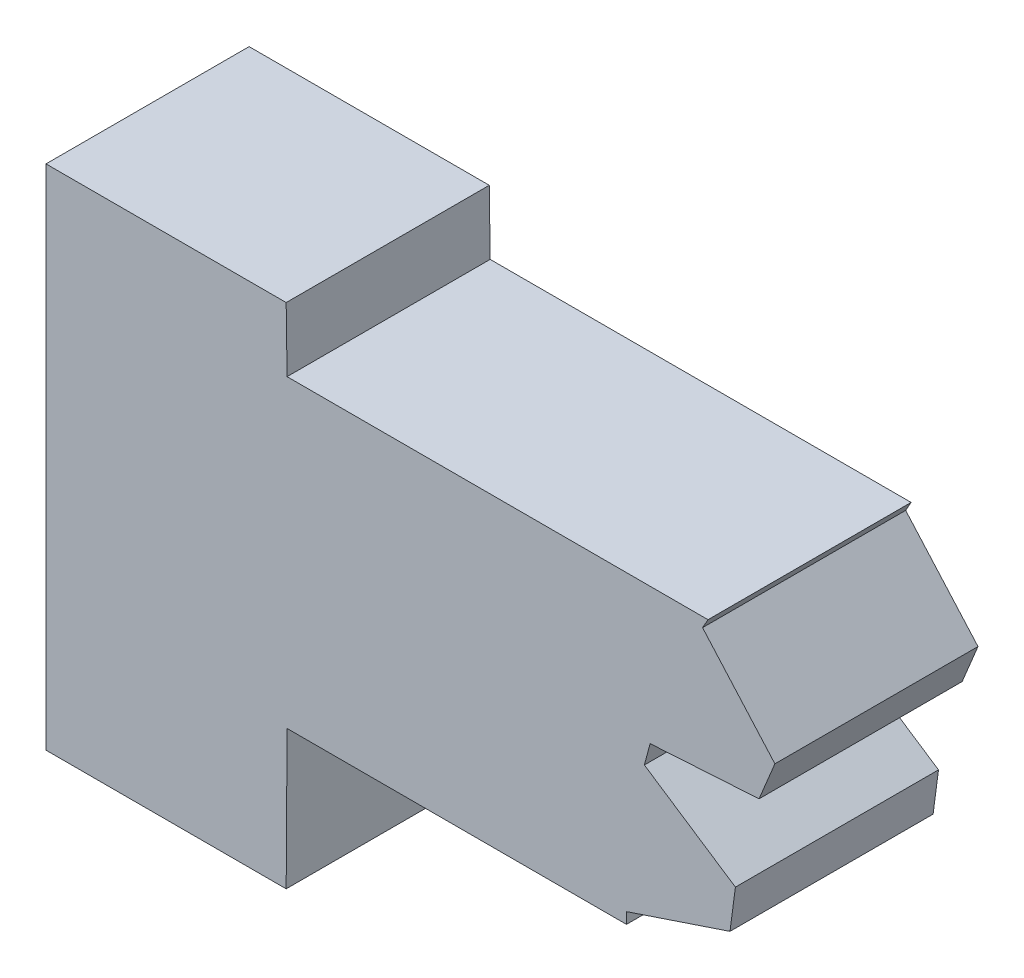
ISO-10303-21;
HEADER;
FILE_DESCRIPTION(('STEP AP214'),'2;1');
FILE_NAME('part.step','',(''),(''),'','','');
FILE_SCHEMA(('AUTOMOTIVE_DESIGN { 1 0 10303 214 1 1 1 1 }'));
ENDSEC;
DATA;
#1=APPLICATION_CONTEXT('core data for automotive mechanical design processes');
#2=APPLICATION_PROTOCOL_DEFINITION('international standard','automotive_design',2000,#1);
#3=PRODUCT_CONTEXT('',#1,'mechanical');
#4=PRODUCT('Part','Part','',(#3));
#5=PRODUCT_RELATED_PRODUCT_CATEGORY('part','',(#4));
#6=PRODUCT_DEFINITION_FORMATION('','',#4);
#7=PRODUCT_DEFINITION_CONTEXT('part definition',#1,'design');
#8=PRODUCT_DEFINITION('design','',#6,#7);
#9=PRODUCT_DEFINITION_SHAPE('','',#8);
#10=(LENGTH_UNIT() NAMED_UNIT(*) SI_UNIT(.MILLI.,.METRE.));
#11=(NAMED_UNIT(*) PLANE_ANGLE_UNIT() SI_UNIT($,.RADIAN.));
#12=(NAMED_UNIT(*) SI_UNIT($,.STERADIAN.) SOLID_ANGLE_UNIT());
#13=UNCERTAINTY_MEASURE_WITH_UNIT(LENGTH_MEASURE(1.E-05),#10,'distance_accuracy_value','');
#14=(GEOMETRIC_REPRESENTATION_CONTEXT(3) GLOBAL_UNCERTAINTY_ASSIGNED_CONTEXT((#13)) GLOBAL_UNIT_ASSIGNED_CONTEXT((#10,
#11,#12)) REPRESENTATION_CONTEXT('',''));
#15=CARTESIAN_POINT('',(0.,0.,0.));
#16=DIRECTION('',(0.,0.,1.));
#17=DIRECTION('',(1.,0.,0.));
#18=AXIS2_PLACEMENT_3D('',#15,#16,#17);
#19=CARTESIAN_POINT('',(12.9304605352733,8.55490384085248,4.));
#20=DIRECTION('',(-0.870533332407199,0.492109456491152,0.));
#21=DIRECTION('',(-0.492109456491152,-0.870533332407199,0.));
#22=AXIS2_PLACEMENT_3D('',#19,#20,#21);
#23=PLANE('',#22);
#24=DIRECTION('',(0.492109456491152,0.870533332407199,0.));
#25=VECTOR('',#24,1.);
#26=CARTESIAN_POINT('',(12.9304605352733,8.55490384085248,0.));
#27=LINE('',#26,#25);
#28=CARTESIAN_POINT('',(12.9304605352733,8.55490384085248,0.));
#29=VERTEX_POINT('',#28);
#30=CARTESIAN_POINT('',(13.0377837049311,8.74475671869166,0.));
#31=VERTEX_POINT('',#30);
#32=EDGE_CURVE('E177',#29,#31,#27,.T.);
#33=ORIENTED_EDGE('',*,*,#32,.T.);
#34=DIRECTION('',(0.,0.,-1.));
#35=VECTOR('',#34,1.);
#36=CARTESIAN_POINT('',(13.0377837049311,8.74475671869166,4.));
#37=LINE('',#36,#35);
#38=CARTESIAN_POINT('',(13.0377837049311,8.74475671869166,4.));
#39=VERTEX_POINT('',#38);
#40=EDGE_CURVE('E11',#39,#31,#37,.T.);
#41=ORIENTED_EDGE('',*,*,#40,.F.);
#42=DIRECTION('',(0.492109456491152,0.870533332407199,0.));
#43=VECTOR('',#42,1.);
#44=CARTESIAN_POINT('',(12.9304605352733,8.55490384085248,4.));
#45=LINE('',#44,#43);
#46=CARTESIAN_POINT('',(12.9304605352733,8.55490384085248,4.));
#47=VERTEX_POINT('',#46);
#48=EDGE_CURVE('E207',#47,#39,#45,.T.);
#49=ORIENTED_EDGE('',*,*,#48,.F.);
#50=DIRECTION('',(0.,0.,-1.));
#51=VECTOR('',#50,1.);
#52=CARTESIAN_POINT('',(12.9304605352733,8.55490384085248,4.));
#53=LINE('',#52,#51);
#54=EDGE_CURVE('E173',#47,#29,#53,.T.);
#55=ORIENTED_EDGE('',*,*,#54,.T.);
#56=EDGE_LOOP('',(#33,#41,#49,#55));
#57=FACE_BOUND('',#56,.T.);
#58=ADVANCED_FACE('F33',(#57),#23,.F.);
#59=CARTESIAN_POINT('',(4.74778370493112,8.74475671869166,4.));
#60=DIRECTION('',(0.,-1.,0.));
#61=DIRECTION('',(0.,0.,-1.));
#62=AXIS2_PLACEMENT_3D('',#59,#60,#61);
#63=PLANE('',#62);
#64=DIRECTION('',(-1.,0.,0.));
#65=VECTOR('',#64,1.);
#66=CARTESIAN_POINT('',(4.74778370493112,8.74475671869166,0.));
#67=LINE('',#66,#65);
#68=CARTESIAN_POINT('',(4.74778370493112,8.74475671869166,0.));
#69=VERTEX_POINT('',#68);
#70=EDGE_CURVE('E180',#31,#69,#67,.T.);
#71=ORIENTED_EDGE('',*,*,#70,.T.);
#72=DIRECTION('',(0.,0.,-1.));
#73=VECTOR('',#72,1.);
#74=CARTESIAN_POINT('',(4.74778370493112,8.74475671869166,4.));
#75=LINE('',#74,#73);
#76=CARTESIAN_POINT('',(4.74778370493112,8.74475671869166,4.));
#77=VERTEX_POINT('',#76);
#78=EDGE_CURVE('E41',#77,#69,#75,.T.);
#79=ORIENTED_EDGE('',*,*,#78,.F.);
#80=DIRECTION('',(-1.,0.,0.));
#81=VECTOR('',#80,1.);
#82=CARTESIAN_POINT('',(4.74778370493112,8.74475671869166,4.));
#83=LINE('',#82,#81);
#84=EDGE_CURVE('E116',#39,#77,#83,.T.);
#85=ORIENTED_EDGE('',*,*,#84,.F.);
#86=ORIENTED_EDGE('',*,*,#40,.T.);
#87=EDGE_LOOP('',(#71,#79,#85,#86));
#88=FACE_BOUND('',#87,.T.);
#89=ADVANCED_FACE('F305',(#88),#63,.F.);
#90=CARTESIAN_POINT('',(4.73,10.,4.));
#91=DIRECTION('',(-0.999899655561117,-0.01416611480819,0.));
#92=DIRECTION('',(0.01416611480819,-0.999899655561117,0.));
#93=AXIS2_PLACEMENT_3D('',#90,#91,#92);
#94=PLANE('',#93);
#95=DIRECTION('',(-0.01416611480819,0.999899655561117,0.));
#96=VECTOR('',#95,1.);
#97=CARTESIAN_POINT('',(4.73,10.,0.));
#98=LINE('',#97,#96);
#99=CARTESIAN_POINT('',(4.73,10.,0.));
#100=VERTEX_POINT('',#99);
#101=EDGE_CURVE('E182',#69,#100,#98,.T.);
#102=ORIENTED_EDGE('',*,*,#101,.T.);
#103=DIRECTION('',(0.,0.,-1.));
#104=VECTOR('',#103,1.);
#105=CARTESIAN_POINT('',(4.73,10.,4.));
#106=LINE('',#105,#104);
#107=CARTESIAN_POINT('',(4.73,10.,4.));
#108=VERTEX_POINT('',#107);
#109=EDGE_CURVE('E238',#108,#100,#106,.T.);
#110=ORIENTED_EDGE('',*,*,#109,.F.);
#111=DIRECTION('',(-0.01416611480819,0.999899655561117,0.));
#112=VECTOR('',#111,1.);
#113=CARTESIAN_POINT('',(4.73,10.,4.));
#114=LINE('',#113,#112);
#115=EDGE_CURVE('E246',#77,#108,#114,.T.);
#116=ORIENTED_EDGE('',*,*,#115,.F.);
#117=ORIENTED_EDGE('',*,*,#78,.T.);
#118=EDGE_LOOP('',(#102,#110,#116,#117));
#119=FACE_BOUND('',#118,.T.);
#120=ADVANCED_FACE('F244',(#119),#94,.F.);
#121=CARTESIAN_POINT('',(4.73,10.,4.));
#122=DIRECTION('',(0.,-1.,0.));
#123=DIRECTION('',(0.,0.,-1.));
#124=AXIS2_PLACEMENT_3D('',#121,#122,#123);
#125=PLANE('',#124);
#126=DIRECTION('',(-1.,0.,0.));
#127=VECTOR('',#126,1.);
#128=CARTESIAN_POINT('',(4.73,10.,0.));
#129=LINE('',#128,#127);
#130=CARTESIAN_POINT('',(0.,10.,0.));
#131=VERTEX_POINT('',#130);
#132=EDGE_CURVE('E184',#100,#131,#129,.T.);
#133=ORIENTED_EDGE('',*,*,#132,.T.);
#134=DIRECTION('',(0.,0.,-1.));
#135=VECTOR('',#134,1.);
#136=CARTESIAN_POINT('',(0.,10.,4.));
#137=LINE('',#136,#135);
#138=CARTESIAN_POINT('',(0.,10.,4.));
#139=VERTEX_POINT('',#138);
#140=EDGE_CURVE('E235',#139,#131,#137,.T.);
#141=ORIENTED_EDGE('',*,*,#140,.F.);
#142=DIRECTION('',(-1.,0.,0.));
#143=VECTOR('',#142,1.);
#144=CARTESIAN_POINT('',(4.73,10.,4.));
#145=LINE('',#144,#143);
#146=EDGE_CURVE('E264',#108,#139,#145,.T.);
#147=ORIENTED_EDGE('',*,*,#146,.F.);
#148=ORIENTED_EDGE('',*,*,#109,.T.);
#149=EDGE_LOOP('',(#133,#141,#147,#148));
#150=FACE_BOUND('',#149,.T.);
#151=ADVANCED_FACE('F255',(#150),#125,.F.);
#152=CARTESIAN_POINT('',(0.,0.,4.));
#153=DIRECTION('',(1.,0.,0.));
#154=DIRECTION('',(0.,0.,-1.));
#155=AXIS2_PLACEMENT_3D('',#152,#153,#154);
#156=PLANE('',#155);
#157=DIRECTION('',(0.,-1.,0.));
#158=VECTOR('',#157,1.);
#159=CARTESIAN_POINT('',(0.,0.,0.));
#160=LINE('',#159,#158);
#161=CARTESIAN_POINT('',(0.,0.,0.));
#162=VERTEX_POINT('',#161);
#163=EDGE_CURVE('E186',#131,#162,#160,.T.);
#164=ORIENTED_EDGE('',*,*,#163,.T.);
#165=DIRECTION('',(0.,0.,-1.));
#166=VECTOR('',#165,1.);
#167=CARTESIAN_POINT('',(0.,0.,4.));
#168=LINE('',#167,#166);
#169=CARTESIAN_POINT('',(0.,0.,4.));
#170=VERTEX_POINT('',#169);
#171=EDGE_CURVE('E232',#170,#162,#168,.T.);
#172=ORIENTED_EDGE('',*,*,#171,.F.);
#173=DIRECTION('',(0.,-1.,0.));
#174=VECTOR('',#173,1.);
#175=CARTESIAN_POINT('',(0.,0.,4.));
#176=LINE('',#175,#174);
#177=EDGE_CURVE('E261',#139,#170,#176,.T.);
#178=ORIENTED_EDGE('',*,*,#177,.F.);
#179=ORIENTED_EDGE('',*,*,#140,.T.);
#180=EDGE_LOOP('',(#164,#172,#178,#179));
#181=FACE_BOUND('',#180,.T.);
#182=ADVANCED_FACE('F259',(#181),#156,.F.);
#183=CARTESIAN_POINT('',(4.73,0.,4.));
#184=DIRECTION('',(0.,1.,0.));
#185=DIRECTION('',(0.,0.,1.));
#186=AXIS2_PLACEMENT_3D('',#183,#184,#185);
#187=PLANE('',#186);
#188=DIRECTION('',(1.,0.,0.));
#189=VECTOR('',#188,1.);
#190=CARTESIAN_POINT('',(4.73,0.,0.));
#191=LINE('',#190,#189);
#192=CARTESIAN_POINT('',(4.73,0.,0.));
#193=VERTEX_POINT('',#192);
#194=EDGE_CURVE('E188',#162,#193,#191,.T.);
#195=ORIENTED_EDGE('',*,*,#194,.T.);
#196=DIRECTION('',(0.,0.,-1.));
#197=VECTOR('',#196,1.);
#198=CARTESIAN_POINT('',(4.73,0.,4.));
#199=LINE('',#198,#197);
#200=CARTESIAN_POINT('',(4.73,0.,4.));
#201=VERTEX_POINT('',#200);
#202=EDGE_CURVE('E229',#201,#193,#199,.T.);
#203=ORIENTED_EDGE('',*,*,#202,.F.);
#204=DIRECTION('',(1.,0.,0.));
#205=VECTOR('',#204,1.);
#206=CARTESIAN_POINT('',(4.73,0.,4.));
#207=LINE('',#206,#205);
#208=EDGE_CURVE('E263',#170,#201,#207,.T.);
#209=ORIENTED_EDGE('',*,*,#208,.F.);
#210=ORIENTED_EDGE('',*,*,#171,.T.);
#211=EDGE_LOOP('',(#195,#203,#209,#210));
#212=FACE_BOUND('',#211,.T.);
#213=ADVANCED_FACE('F318',(#212),#187,.F.);
#214=CARTESIAN_POINT('',(4.74778370493112,2.74476455823996,4.));
#215=DIRECTION('',(-0.999979011054282,0.00647900076402233,0.));
#216=DIRECTION('',(-0.00647900076402233,-0.999979011054282,0.));
#217=AXIS2_PLACEMENT_3D('',#214,#215,#216);
#218=PLANE('',#217);
#219=DIRECTION('',(0.00647900076402233,0.999979011054282,0.));
#220=VECTOR('',#219,1.);
#221=CARTESIAN_POINT('',(4.74778370493112,2.74476455823996,0.));
#222=LINE('',#221,#220);
#223=CARTESIAN_POINT('',(4.74778370493112,2.74476455823996,0.));
#224=VERTEX_POINT('',#223);
#225=EDGE_CURVE('E190',#193,#224,#222,.T.);
#226=ORIENTED_EDGE('',*,*,#225,.T.);
#227=DIRECTION('',(0.,0.,-1.));
#228=VECTOR('',#227,1.);
#229=CARTESIAN_POINT('',(4.74778370493112,2.74476455823996,4.));
#230=LINE('',#229,#228);
#231=CARTESIAN_POINT('',(4.74778370493112,2.74476455823996,4.));
#232=VERTEX_POINT('',#231);
#233=EDGE_CURVE('E226',#232,#224,#230,.T.);
#234=ORIENTED_EDGE('',*,*,#233,.F.);
#235=DIRECTION('',(0.00647900076402233,0.999979011054282,0.));
#236=VECTOR('',#235,1.);
#237=CARTESIAN_POINT('',(4.74778370493112,2.74476455823996,4.));
#238=LINE('',#237,#236);
#239=EDGE_CURVE('E266',#201,#232,#238,.T.);
#240=ORIENTED_EDGE('',*,*,#239,.F.);
#241=ORIENTED_EDGE('',*,*,#202,.T.);
#242=EDGE_LOOP('',(#226,#234,#240,#241));
#243=FACE_BOUND('',#242,.T.);
#244=ADVANCED_FACE('F321',(#243),#218,.F.);
#245=CARTESIAN_POINT('',(4.74778370493112,2.74476455823996,4.));
#246=DIRECTION('',(0.,1.,0.));
#247=DIRECTION('',(0.,0.,1.));
#248=AXIS2_PLACEMENT_3D('',#245,#246,#247);
#249=PLANE('',#248);
#250=DIRECTION('',(1.,0.,0.));
#251=VECTOR('',#250,1.);
#252=CARTESIAN_POINT('',(4.74778370493112,2.74476455823996,0.));
#253=LINE('',#252,#251);
#254=CARTESIAN_POINT('',(11.4320749114308,2.74476455823996,0.));
#255=VERTEX_POINT('',#254);
#256=EDGE_CURVE('E192',#224,#255,#253,.T.);
#257=ORIENTED_EDGE('',*,*,#256,.T.);
#258=DIRECTION('',(0.,0.,-1.));
#259=VECTOR('',#258,1.);
#260=CARTESIAN_POINT('',(11.4320749114308,2.74476455823996,4.));
#261=LINE('',#260,#259);
#262=CARTESIAN_POINT('',(11.4320749114308,2.74476455823996,4.));
#263=VERTEX_POINT('',#262);
#264=EDGE_CURVE('E223',#263,#255,#261,.T.);
#265=ORIENTED_EDGE('',*,*,#264,.F.);
#266=DIRECTION('',(1.,0.,0.));
#267=VECTOR('',#266,1.);
#268=CARTESIAN_POINT('',(4.74778370493112,2.74476455823996,4.));
#269=LINE('',#268,#267);
#270=EDGE_CURVE('E272',#232,#263,#269,.T.);
#271=ORIENTED_EDGE('',*,*,#270,.F.);
#272=ORIENTED_EDGE('',*,*,#233,.T.);
#273=EDGE_LOOP('',(#257,#265,#271,#272));
#274=FACE_BOUND('',#273,.T.);
#275=ADVANCED_FACE('F325',(#274),#249,.F.);
#276=CARTESIAN_POINT('',(11.4320749114308,2.74476455823996,4.));
#277=DIRECTION('',(-1.,0.,0.));
#278=DIRECTION('',(0.,0.,1.));
#279=AXIS2_PLACEMENT_3D('',#276,#277,#278);
#280=PLANE('',#279);
#281=DIRECTION('',(0.,1.,0.));
#282=VECTOR('',#281,1.);
#283=CARTESIAN_POINT('',(11.4320749114308,2.74476455823996,0.));
#284=LINE('',#283,#282);
#285=CARTESIAN_POINT('',(11.4320749114308,2.96285256334162,0.));
#286=VERTEX_POINT('',#285);
#287=EDGE_CURVE('E194',#255,#286,#284,.T.);
#288=ORIENTED_EDGE('',*,*,#287,.T.);
#289=DIRECTION('',(0.,0.,-1.));
#290=VECTOR('',#289,1.);
#291=CARTESIAN_POINT('',(11.4320749114308,2.96285256334162,4.));
#292=LINE('',#291,#290);
#293=CARTESIAN_POINT('',(11.4320749114308,2.96285256334162,4.));
#294=VERTEX_POINT('',#293);
#295=EDGE_CURVE('E220',#294,#286,#292,.T.);
#296=ORIENTED_EDGE('',*,*,#295,.F.);
#297=DIRECTION('',(0.,1.,0.));
#298=VECTOR('',#297,1.);
#299=CARTESIAN_POINT('',(11.4320749114308,2.74476455823996,4.));
#300=LINE('',#299,#298);
#301=EDGE_CURVE('E274',#263,#294,#300,.T.);
#302=ORIENTED_EDGE('',*,*,#301,.F.);
#303=ORIENTED_EDGE('',*,*,#264,.T.);
#304=EDGE_LOOP('',(#288,#296,#302,#303));
#305=FACE_BOUND('',#304,.T.);
#306=ADVANCED_FACE('F329',(#305),#280,.F.);
#307=CARTESIAN_POINT('',(11.4320749114308,2.96285256334162,4.));
#308=DIRECTION('',(-0.31722342524605,0.948350830903397,0.));
#309=DIRECTION('',(-0.948350830903397,-0.31722342524605,0.));
#310=AXIS2_PLACEMENT_3D('',#307,#308,#309);
#311=PLANE('',#310);
#312=DIRECTION('',(0.948350830903397,0.31722342524605,0.));
#313=VECTOR('',#312,1.);
#314=CARTESIAN_POINT('',(11.4320749114308,2.96285256334162,0.));
#315=LINE('',#314,#313);
#316=CARTESIAN_POINT('',(13.4706753283553,3.64476455823994,0.));
#317=VERTEX_POINT('',#316);
#318=EDGE_CURVE('E196',#286,#317,#315,.T.);
#319=ORIENTED_EDGE('',*,*,#318,.T.);
#320=DIRECTION('',(0.,0.,-1.));
#321=VECTOR('',#320,1.);
#322=CARTESIAN_POINT('',(13.4706753283553,3.64476455823994,4.));
#323=LINE('',#322,#321);
#324=CARTESIAN_POINT('',(13.4706753283553,3.64476455823994,4.));
#325=VERTEX_POINT('',#324);
#326=EDGE_CURVE('E217',#325,#317,#323,.T.);
#327=ORIENTED_EDGE('',*,*,#326,.F.);
#328=DIRECTION('',(0.948350830903397,0.31722342524605,0.));
#329=VECTOR('',#328,1.);
#330=CARTESIAN_POINT('',(11.4320749114308,2.96285256334162,4.));
#331=LINE('',#330,#329);
#332=EDGE_CURVE('E276',#294,#325,#331,.T.);
#333=ORIENTED_EDGE('',*,*,#332,.F.);
#334=ORIENTED_EDGE('',*,*,#295,.T.);
#335=EDGE_LOOP('',(#319,#327,#333,#334));
#336=FACE_BOUND('',#335,.T.);
#337=ADVANCED_FACE('F333',(#336),#311,.F.);
#338=CARTESIAN_POINT('',(13.4706753283553,3.64476455823994,4.));
#339=DIRECTION('',(-0.991444861373811,0.130526192220048,0.));
#340=DIRECTION('',(-0.130526192220048,-0.991444861373811,0.));
#341=AXIS2_PLACEMENT_3D('',#338,#339,#340);
#342=PLANE('',#341);
#343=DIRECTION('',(0.130526192220048,0.991444861373811,0.));
#344=VECTOR('',#343,1.);
#345=CARTESIAN_POINT('',(13.4706753283553,3.64476455823994,0.));
#346=LINE('',#345,#344);
#347=CARTESIAN_POINT('',(13.5770971149535,4.45311828147681,0.));
#348=VERTEX_POINT('',#347);
#349=EDGE_CURVE('E198',#317,#348,#346,.T.);
#350=ORIENTED_EDGE('',*,*,#349,.T.);
#351=DIRECTION('',(0.,0.,-1.));
#352=VECTOR('',#351,1.);
#353=CARTESIAN_POINT('',(13.5770971149535,4.45311828147681,4.));
#354=LINE('',#353,#352);
#355=CARTESIAN_POINT('',(13.5770971149535,4.45311828147681,4.));
#356=VERTEX_POINT('',#355);
#357=EDGE_CURVE('E214',#356,#348,#354,.T.);
#358=ORIENTED_EDGE('',*,*,#357,.F.);
#359=DIRECTION('',(0.130526192220048,0.991444861373811,0.));
#360=VECTOR('',#359,1.);
#361=CARTESIAN_POINT('',(13.4706753283553,3.64476455823994,4.));
#362=LINE('',#361,#360);
#363=EDGE_CURVE('E278',#325,#356,#362,.T.);
#364=ORIENTED_EDGE('',*,*,#363,.F.);
#365=ORIENTED_EDGE('',*,*,#326,.T.);
#366=EDGE_LOOP('',(#350,#358,#364,#365));
#367=FACE_BOUND('',#366,.T.);
#368=ADVANCED_FACE('F337',(#367),#342,.F.);
#369=CARTESIAN_POINT('',(13.5770971149535,4.45311828147681,4.));
#370=DIRECTION('',(-0.551865555625634,-0.833933095945958,0.));
#371=DIRECTION('',(0.833933095945958,-0.551865555625634,0.));
#372=AXIS2_PLACEMENT_3D('',#369,#370,#371);
#373=PLANE('',#372);
#374=DIRECTION('',(-0.833933095945958,0.551865555625634,0.));
#375=VECTOR('',#374,1.);
#376=CARTESIAN_POINT('',(13.5770971149535,4.45311828147681,0.));
#377=LINE('',#376,#375);
#378=CARTESIAN_POINT('',(11.784452134126,5.63942330185938,0.));
#379=VERTEX_POINT('',#378);
#380=EDGE_CURVE('E200',#348,#379,#377,.T.);
#381=ORIENTED_EDGE('',*,*,#380,.T.);
#382=DIRECTION('',(0.,0.,-1.));
#383=VECTOR('',#382,1.);
#384=CARTESIAN_POINT('',(11.784452134126,5.63942330185938,4.));
#385=LINE('',#384,#383);
#386=CARTESIAN_POINT('',(11.784452134126,5.63942330185938,4.));
#387=VERTEX_POINT('',#386);
#388=EDGE_CURVE('E211',#387,#379,#385,.T.);
#389=ORIENTED_EDGE('',*,*,#388,.F.);
#390=DIRECTION('',(-0.833933095945958,0.551865555625634,0.));
#391=VECTOR('',#390,1.);
#392=CARTESIAN_POINT('',(13.5770971149535,4.45311828147681,4.));
#393=LINE('',#392,#391);
#394=EDGE_CURVE('E280',#356,#387,#393,.T.);
#395=ORIENTED_EDGE('',*,*,#394,.F.);
#396=ORIENTED_EDGE('',*,*,#357,.T.);
#397=EDGE_LOOP('',(#381,#389,#395,#396));
#398=FACE_BOUND('',#397,.T.);
#399=ADVANCED_FACE('F286',(#398),#373,.F.);
#400=CARTESIAN_POINT('',(11.784452134126,5.63942330185938,4.));
#401=DIRECTION('',(-0.965925826289063,0.258819045102539,0.));
#402=DIRECTION('',(-0.258819045102539,-0.965925826289063,0.));
#403=AXIS2_PLACEMENT_3D('',#400,#401,#402);
#404=PLANE('',#403);
#405=DIRECTION('',(0.258819045102539,0.965925826289064,0.));
#406=VECTOR('',#405,1.);
#407=CARTESIAN_POINT('',(11.784452134126,5.63942330185938,0.));
#408=LINE('',#407,#406);
#409=CARTESIAN_POINT('',(11.8973427925835,6.06073697492256,0.));
#410=VERTEX_POINT('',#409);
#411=EDGE_CURVE('E202',#379,#410,#408,.T.);
#412=ORIENTED_EDGE('',*,*,#411,.T.);
#413=DIRECTION('',(0.,0.,-1.));
#414=VECTOR('',#413,1.);
#415=CARTESIAN_POINT('',(11.8973427925835,6.06073697492256,4.));
#416=LINE('',#415,#414);
#417=CARTESIAN_POINT('',(11.8973427925835,6.06073697492256,4.));
#418=VERTEX_POINT('',#417);
#419=EDGE_CURVE('E168',#418,#410,#416,.T.);
#420=ORIENTED_EDGE('',*,*,#419,.F.);
#421=DIRECTION('',(0.258819045102539,0.965925826289064,0.));
#422=VECTOR('',#421,1.);
#423=CARTESIAN_POINT('',(11.784452134126,5.63942330185938,4.));
#424=LINE('',#423,#422);
#425=EDGE_CURVE('E159',#387,#418,#424,.T.);
#426=ORIENTED_EDGE('',*,*,#425,.F.);
#427=ORIENTED_EDGE('',*,*,#388,.T.);
#428=EDGE_LOOP('',(#412,#420,#426,#427));
#429=FACE_BOUND('',#428,.T.);
#430=ADVANCED_FACE('F290',(#429),#404,.F.);
#431=CARTESIAN_POINT('',(11.8973427925835,6.06073697492256,4.));
#432=DIRECTION('',(-0.060963042672375,0.998140023958626,0.));
#433=DIRECTION('',(-0.998140023958626,-0.060963042672375,0.));
#434=AXIS2_PLACEMENT_3D('',#431,#432,#433);
#435=PLANE('',#434);
#436=DIRECTION('',(0.998140023958626,0.060963042672375,0.));
#437=VECTOR('',#436,1.);
#438=CARTESIAN_POINT('',(11.8973427925835,6.06073697492256,0.));
#439=LINE('',#438,#437);
#440=CARTESIAN_POINT('',(14.0429713961381,6.19178476879701,0.));
#441=VERTEX_POINT('',#440);
#442=EDGE_CURVE('E167',#410,#441,#439,.T.);
#443=ORIENTED_EDGE('',*,*,#442,.T.);
#444=DIRECTION('',(0.,0.,-1.));
#445=VECTOR('',#444,1.);
#446=CARTESIAN_POINT('',(14.0429713961381,6.19178476879701,4.));
#447=LINE('',#446,#445);
#448=CARTESIAN_POINT('',(14.0429713961381,6.19178476879701,4.));
#449=VERTEX_POINT('',#448);
#450=EDGE_CURVE('E164',#449,#441,#447,.T.);
#451=ORIENTED_EDGE('',*,*,#450,.F.);
#452=DIRECTION('',(0.998140023958626,0.060963042672375,0.));
#453=VECTOR('',#452,1.);
#454=CARTESIAN_POINT('',(11.8973427925835,6.06073697492256,4.));
#455=LINE('',#454,#453);
#456=EDGE_CURVE('E153',#418,#449,#455,.T.);
#457=ORIENTED_EDGE('',*,*,#456,.F.);
#458=ORIENTED_EDGE('',*,*,#419,.T.);
#459=EDGE_LOOP('',(#443,#451,#457,#458));
#460=FACE_BOUND('',#459,.T.);
#461=ADVANCED_FACE('F165',(#460),#435,.F.);
#462=CARTESIAN_POINT('',(14.0429713961381,6.19178476879701,4.));
#463=DIRECTION('',(-0.923879532511289,0.382683432365085,0.));
#464=DIRECTION('',(-0.382683432365085,-0.923879532511289,0.));
#465=AXIS2_PLACEMENT_3D('',#462,#463,#464);
#466=PLANE('',#465);
#467=DIRECTION('',(0.382683432365085,0.923879532511289,0.));
#468=VECTOR('',#467,1.);
#469=CARTESIAN_POINT('',(14.0429713961381,6.19178476879701,0.));
#470=LINE('',#469,#468);
#471=CARTESIAN_POINT('',(14.3549842870463,6.94505052166298,0.));
#472=VERTEX_POINT('',#471);
#473=EDGE_CURVE('E102',#441,#472,#470,.T.);
#474=ORIENTED_EDGE('',*,*,#473,.T.);
#475=DIRECTION('',(0.,0.,-1.));
#476=VECTOR('',#475,1.);
#477=CARTESIAN_POINT('',(14.3549842870463,6.94505052166298,4.));
#478=LINE('',#477,#476);
#479=CARTESIAN_POINT('',(14.3549842870463,6.94505052166298,4.));
#480=VERTEX_POINT('',#479);
#481=EDGE_CURVE('E169',#480,#472,#478,.T.);
#482=ORIENTED_EDGE('',*,*,#481,.F.);
#483=DIRECTION('',(0.382683432365085,0.923879532511289,0.));
#484=VECTOR('',#483,1.);
#485=CARTESIAN_POINT('',(14.0429713961381,6.19178476879701,4.));
#486=LINE('',#485,#484);
#487=EDGE_CURVE('E157',#449,#480,#486,.T.);
#488=ORIENTED_EDGE('',*,*,#487,.F.);
#489=ORIENTED_EDGE('',*,*,#450,.T.);
#490=EDGE_LOOP('',(#474,#482,#488,#489));
#491=FACE_BOUND('',#490,.T.);
#492=ADVANCED_FACE('F171',(#491),#466,.F.);
#493=CARTESIAN_POINT('',(14.3549842870463,6.94505052166298,4.));
#494=DIRECTION('',(-0.748898960390284,-0.662684198639407,0.));
#495=DIRECTION('',(0.662684198639407,-0.748898960390284,0.));
#496=AXIS2_PLACEMENT_3D('',#493,#494,#495);
#497=PLANE('',#496);
#498=DIRECTION('',(-0.662684198639407,0.748898960390284,0.));
#499=VECTOR('',#498,1.);
#500=CARTESIAN_POINT('',(14.3549842870463,6.94505052166298,0.));
#501=LINE('',#500,#499);
#502=EDGE_CURVE('E108',#472,#29,#501,.T.);
#503=ORIENTED_EDGE('',*,*,#502,.T.);
#504=ORIENTED_EDGE('',*,*,#54,.F.);
#505=DIRECTION('',(-0.662684198639407,0.748898960390284,0.));
#506=VECTOR('',#505,1.);
#507=CARTESIAN_POINT('',(14.3549842870463,6.94505052166298,4.));
#508=LINE('',#507,#506);
#509=EDGE_CURVE('E49',#480,#47,#508,.T.);
#510=ORIENTED_EDGE('',*,*,#509,.F.);
#511=ORIENTED_EDGE('',*,*,#481,.T.);
#512=EDGE_LOOP('',(#503,#504,#510,#511));
#513=FACE_BOUND('',#512,.T.);
#514=ADVANCED_FACE('F294',(#513),#497,.F.);
#515=CARTESIAN_POINT('',(0.,0.,4.));
#516=DIRECTION('',(0.,0.,1.));
#517=DIRECTION('',(1.,0.,0.));
#518=AXIS2_PLACEMENT_3D('',#515,#516,#517);
#519=PLANE('',#518);
#520=ORIENTED_EDGE('',*,*,#48,.T.);
#521=ORIENTED_EDGE('',*,*,#84,.T.);
#522=ORIENTED_EDGE('',*,*,#115,.T.);
#523=ORIENTED_EDGE('',*,*,#146,.T.);
#524=ORIENTED_EDGE('',*,*,#177,.T.);
#525=ORIENTED_EDGE('',*,*,#208,.T.);
#526=ORIENTED_EDGE('',*,*,#239,.T.);
#527=ORIENTED_EDGE('',*,*,#270,.T.);
#528=ORIENTED_EDGE('',*,*,#301,.T.);
#529=ORIENTED_EDGE('',*,*,#332,.T.);
#530=ORIENTED_EDGE('',*,*,#363,.T.);
#531=ORIENTED_EDGE('',*,*,#394,.T.);
#532=ORIENTED_EDGE('',*,*,#425,.T.);
#533=ORIENTED_EDGE('',*,*,#456,.T.);
#534=ORIENTED_EDGE('',*,*,#487,.T.);
#535=ORIENTED_EDGE('',*,*,#509,.T.);
#536=EDGE_LOOP('',(#520,#521,#522,#523,#524,#525,#526,#527,#528,#529,#530,#531,#532,#533,#534,#535));
#537=FACE_BOUND('',#536,.T.);
#538=ADVANCED_FACE('F155',(#537),#519,.T.);
#539=CARTESIAN_POINT('',(0.,0.,0.));
#540=DIRECTION('',(0.,0.,1.));
#541=DIRECTION('',(1.,0.,0.));
#542=AXIS2_PLACEMENT_3D('',#539,#540,#541);
#543=PLANE('',#542);
#544=ORIENTED_EDGE('',*,*,#32,.F.);
#545=ORIENTED_EDGE('',*,*,#502,.F.);
#546=ORIENTED_EDGE('',*,*,#473,.F.);
#547=ORIENTED_EDGE('',*,*,#442,.F.);
#548=ORIENTED_EDGE('',*,*,#411,.F.);
#549=ORIENTED_EDGE('',*,*,#380,.F.);
#550=ORIENTED_EDGE('',*,*,#349,.F.);
#551=ORIENTED_EDGE('',*,*,#318,.F.);
#552=ORIENTED_EDGE('',*,*,#287,.F.);
#553=ORIENTED_EDGE('',*,*,#256,.F.);
#554=ORIENTED_EDGE('',*,*,#225,.F.);
#555=ORIENTED_EDGE('',*,*,#194,.F.);
#556=ORIENTED_EDGE('',*,*,#163,.F.);
#557=ORIENTED_EDGE('',*,*,#132,.F.);
#558=ORIENTED_EDGE('',*,*,#101,.F.);
#559=ORIENTED_EDGE('',*,*,#70,.F.);
#560=EDGE_LOOP('',(#544,#545,#546,#547,#548,#549,#550,#551,#552,#553,#554,#555,#556,#557,#558,#559));
#561=FACE_BOUND('',#560,.T.);
#562=ADVANCED_FACE('F250',(#561),#543,.F.);
#563=CLOSED_SHELL('',(#58,#89,#120,#151,#182,#213,#244,#275,#306,#337,#368,#399,#430,#461,#492,
#514,#538,#562));
#564=MANIFOLD_SOLID_BREP('B2',#563);
#565=ADVANCED_BREP_SHAPE_REPRESENTATION('',(#18,#564),#14);
#566=SHAPE_DEFINITION_REPRESENTATION(#9,#565);
ENDSEC;
END-ISO-10303-21;
